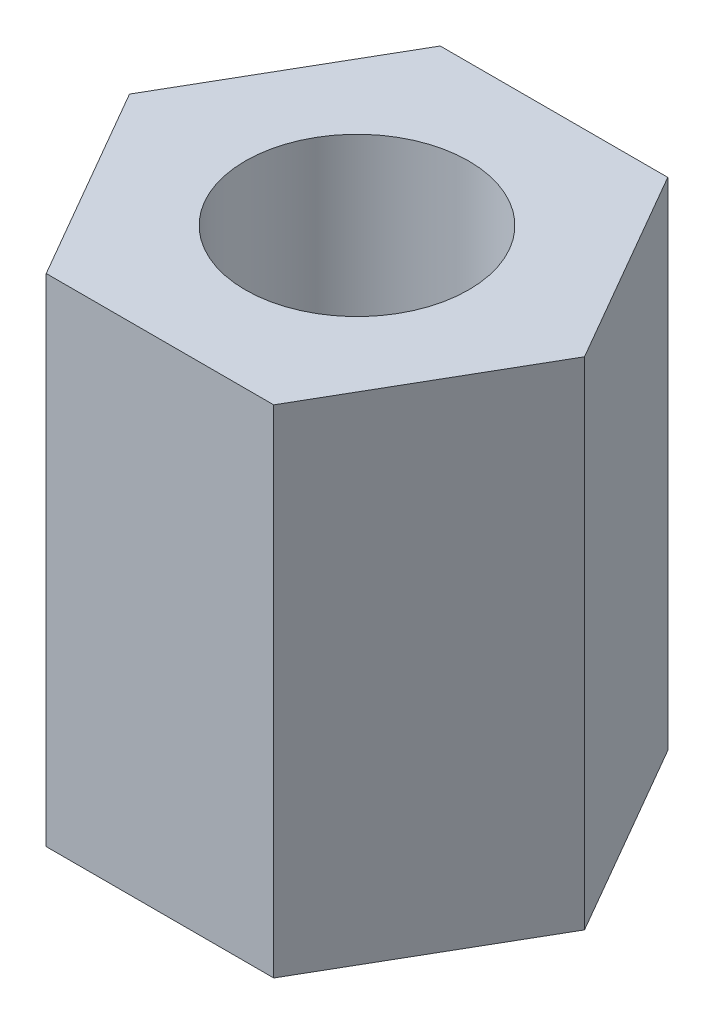
ISO-10303-21;
HEADER;
FILE_DESCRIPTION(('STEP AP214'),'2;1');
FILE_NAME('part.step','',(''),(''),'','','');
FILE_SCHEMA(('AUTOMOTIVE_DESIGN { 1 0 10303 214 1 1 1 1 }'));
ENDSEC;
DATA;
#1=APPLICATION_CONTEXT('core data for automotive mechanical design processes');
#2=APPLICATION_PROTOCOL_DEFINITION('international standard','automotive_design',2000,#1);
#3=PRODUCT_CONTEXT('',#1,'mechanical');
#4=PRODUCT('Part','Part','',(#3));
#5=PRODUCT_RELATED_PRODUCT_CATEGORY('part','',(#4));
#6=PRODUCT_DEFINITION_FORMATION('','',#4);
#7=PRODUCT_DEFINITION_CONTEXT('part definition',#1,'design');
#8=PRODUCT_DEFINITION('design','',#6,#7);
#9=PRODUCT_DEFINITION_SHAPE('','',#8);
#10=(LENGTH_UNIT() NAMED_UNIT(*) SI_UNIT(.MILLI.,.METRE.));
#11=(NAMED_UNIT(*) PLANE_ANGLE_UNIT() SI_UNIT($,.RADIAN.));
#12=(NAMED_UNIT(*) SI_UNIT($,.STERADIAN.) SOLID_ANGLE_UNIT());
#13=UNCERTAINTY_MEASURE_WITH_UNIT(LENGTH_MEASURE(1.E-05),#10,'distance_accuracy_value','');
#14=(GEOMETRIC_REPRESENTATION_CONTEXT(3) GLOBAL_UNCERTAINTY_ASSIGNED_CONTEXT((#13)) GLOBAL_UNIT_ASSIGNED_CONTEXT((#10,
#11,#12)) REPRESENTATION_CONTEXT('',''));
#15=CARTESIAN_POINT('',(0.,0.,0.));
#16=DIRECTION('',(0.,0.,1.));
#17=DIRECTION('',(1.,0.,0.));
#18=AXIS2_PLACEMENT_3D('',#15,#16,#17);
#19=CARTESIAN_POINT('',(0.,6.,0.));
#20=DIRECTION('',(0.,1.,0.));
#21=DIRECTION('',(0.,0.,1.));
#22=AXIS2_PLACEMENT_3D('',#19,#20,#21);
#23=PLANE('',#22);
#24=DIRECTION('',(0.499999999999995,0.,-0.866025403784441));
#25=VECTOR('',#24,1.);
#26=CARTESIAN_POINT('',(1.37500000000003,6.,2.38156986040719));
#27=LINE('',#26,#25);
#28=CARTESIAN_POINT('',(1.37500000000003,6.,2.38156986040719));
#29=VERTEX_POINT('',#28);
#30=CARTESIAN_POINT('',(2.75,6.,0.));
#31=VERTEX_POINT('',#30);
#32=EDGE_CURVE('E128',#29,#31,#27,.T.);
#33=ORIENTED_EDGE('',*,*,#32,.T.);
#34=DIRECTION('',(-0.500000000000001,0.,-0.866025403784438));
#35=VECTOR('',#34,1.);
#36=CARTESIAN_POINT('',(2.75,6.,0.));
#37=LINE('',#36,#35);
#38=CARTESIAN_POINT('',(1.37499999999999,6.,-2.38156986040721));
#39=VERTEX_POINT('',#38);
#40=EDGE_CURVE('E86',#31,#39,#37,.T.);
#41=ORIENTED_EDGE('',*,*,#40,.T.);
#42=DIRECTION('',(-1.,0.,0.));
#43=VECTOR('',#42,1.);
#44=CARTESIAN_POINT('',(1.37499999999999,6.,-2.38156986040721));
#45=LINE('',#44,#43);
#46=CARTESIAN_POINT('',(-1.37500000000001,6.,-2.3815698604072));
#47=VERTEX_POINT('',#46);
#48=EDGE_CURVE('E99',#39,#47,#45,.T.);
#49=ORIENTED_EDGE('',*,*,#48,.T.);
#50=DIRECTION('',(-0.499999999999995,0.,0.866025403784441));
#51=VECTOR('',#50,1.);
#52=CARTESIAN_POINT('',(-1.37500000000001,6.,-2.3815698604072));
#53=LINE('',#52,#51);
#54=CARTESIAN_POINT('',(-2.75,6.,0.));
#55=VERTEX_POINT('',#54);
#56=EDGE_CURVE('E93',#47,#55,#53,.T.);
#57=ORIENTED_EDGE('',*,*,#56,.T.);
#58=DIRECTION('',(0.500000000000007,0.,0.866025403784434));
#59=VECTOR('',#58,1.);
#60=CARTESIAN_POINT('',(-2.75,6.,0.));
#61=LINE('',#60,#59);
#62=CARTESIAN_POINT('',(-1.37499999999998,6.,2.38156986040722));
#63=VERTEX_POINT('',#62);
#64=EDGE_CURVE('E97',#55,#63,#61,.T.);
#65=ORIENTED_EDGE('',*,*,#64,.T.);
#66=DIRECTION('',(1.,0.,0.));
#67=VECTOR('',#66,1.);
#68=CARTESIAN_POINT('',(-1.37499999999998,6.,2.38156986040722));
#69=LINE('',#68,#67);
#70=EDGE_CURVE('E49',#63,#29,#69,.T.);
#71=ORIENTED_EDGE('',*,*,#70,.T.);
#72=EDGE_LOOP('',(#33,#41,#49,#57,#65,#71));
#73=FACE_BOUND('',#72,.T.);
#74=CARTESIAN_POINT('',(0.,6.,0.));
#75=DIRECTION('',(0.,1.,0.));
#76=DIRECTION('',(0.,0.,1.));
#77=AXIS2_PLACEMENT_3D('',#74,#75,#76);
#78=CIRCLE('',#77,1.35);
#79=CARTESIAN_POINT('',(0.,6.,1.35));
#80=VERTEX_POINT('',#79);
#81=EDGE_CURVE('E121',#80,#80,#78,.T.);
#82=ORIENTED_EDGE('',*,*,#81,.F.);
#83=EDGE_LOOP('',(#82));
#84=FACE_BOUND('',#83,.T.);
#85=ADVANCED_FACE('F32',(#73,#84),#23,.T.);
#86=CARTESIAN_POINT('',(0.,0.,0.));
#87=DIRECTION('',(0.,1.,0.));
#88=DIRECTION('',(0.,0.,1.));
#89=AXIS2_PLACEMENT_3D('',#86,#87,#88);
#90=PLANE('',#89);
#91=DIRECTION('',(0.499999999999995,0.,-0.866025403784441));
#92=VECTOR('',#91,1.);
#93=CARTESIAN_POINT('',(1.37500000000003,0.,2.38156986040719));
#94=LINE('',#93,#92);
#95=CARTESIAN_POINT('',(1.37500000000003,0.,2.38156986040719));
#96=VERTEX_POINT('',#95);
#97=CARTESIAN_POINT('',(2.75,0.,0.));
#98=VERTEX_POINT('',#97);
#99=EDGE_CURVE('E117',#96,#98,#94,.T.);
#100=ORIENTED_EDGE('',*,*,#99,.F.);
#101=DIRECTION('',(1.,0.,0.));
#102=VECTOR('',#101,1.);
#103=CARTESIAN_POINT('',(-1.37499999999998,0.,2.38156986040722));
#104=LINE('',#103,#102);
#105=CARTESIAN_POINT('',(-1.37499999999998,0.,2.38156986040722));
#106=VERTEX_POINT('',#105);
#107=EDGE_CURVE('E78',#106,#96,#104,.T.);
#108=ORIENTED_EDGE('',*,*,#107,.F.);
#109=DIRECTION('',(0.500000000000007,0.,0.866025403784434));
#110=VECTOR('',#109,1.);
#111=CARTESIAN_POINT('',(-2.75,0.,0.));
#112=LINE('',#111,#110);
#113=CARTESIAN_POINT('',(-2.75,0.,0.));
#114=VERTEX_POINT('',#113);
#115=EDGE_CURVE('E72',#114,#106,#112,.T.);
#116=ORIENTED_EDGE('',*,*,#115,.F.);
#117=DIRECTION('',(-0.499999999999995,0.,0.866025403784441));
#118=VECTOR('',#117,1.);
#119=CARTESIAN_POINT('',(-1.37500000000001,0.,-2.3815698604072));
#120=LINE('',#119,#118);
#121=CARTESIAN_POINT('',(-1.37500000000001,0.,-2.3815698604072));
#122=VERTEX_POINT('',#121);
#123=EDGE_CURVE('E107',#122,#114,#120,.T.);
#124=ORIENTED_EDGE('',*,*,#123,.F.);
#125=DIRECTION('',(-1.,0.,0.));
#126=VECTOR('',#125,1.);
#127=CARTESIAN_POINT('',(1.37499999999999,0.,-2.38156986040721));
#128=LINE('',#127,#126);
#129=CARTESIAN_POINT('',(1.37499999999999,0.,-2.38156986040721));
#130=VERTEX_POINT('',#129);
#131=EDGE_CURVE('E123',#130,#122,#128,.T.);
#132=ORIENTED_EDGE('',*,*,#131,.F.);
#133=DIRECTION('',(-0.500000000000001,0.,-0.866025403784438));
#134=VECTOR('',#133,1.);
#135=CARTESIAN_POINT('',(2.75,0.,0.));
#136=LINE('',#135,#134);
#137=EDGE_CURVE('E120',#98,#130,#136,.T.);
#138=ORIENTED_EDGE('',*,*,#137,.F.);
#139=EDGE_LOOP('',(#100,#108,#116,#124,#132,#138));
#140=FACE_BOUND('',#139,.T.);
#141=CARTESIAN_POINT('',(0.,0.,0.));
#142=DIRECTION('',(0.,1.,0.));
#143=DIRECTION('',(0.,0.,1.));
#144=AXIS2_PLACEMENT_3D('',#141,#142,#143);
#145=CIRCLE('',#144,1.35);
#146=CARTESIAN_POINT('',(0.,0.,1.35));
#147=VERTEX_POINT('',#146);
#148=EDGE_CURVE('E221',#147,#147,#145,.T.);
#149=ORIENTED_EDGE('',*,*,#148,.T.);
#150=EDGE_LOOP('',(#149));
#151=FACE_BOUND('',#150,.T.);
#152=ADVANCED_FACE('F137',(#140,#151),#90,.F.);
#153=CARTESIAN_POINT('',(1.37500000000003,6.,2.38156986040719));
#154=DIRECTION('',(-0.866025403784442,0.,-0.499999999999995));
#155=DIRECTION('',(-0.499999999999995,0.,0.866025403784442));
#156=AXIS2_PLACEMENT_3D('',#153,#154,#155);
#157=PLANE('',#156);
#158=ORIENTED_EDGE('',*,*,#99,.T.);
#159=DIRECTION('',(0.,-1.,0.));
#160=VECTOR('',#159,1.);
#161=CARTESIAN_POINT('',(2.75,6.,0.));
#162=LINE('',#161,#160);
#163=EDGE_CURVE('E11',#31,#98,#162,.T.);
#164=ORIENTED_EDGE('',*,*,#163,.F.);
#165=ORIENTED_EDGE('',*,*,#32,.F.);
#166=DIRECTION('',(0.,-1.,0.));
#167=VECTOR('',#166,1.);
#168=CARTESIAN_POINT('',(1.37500000000003,6.,2.38156986040719));
#169=LINE('',#168,#167);
#170=EDGE_CURVE('E113',#29,#96,#169,.T.);
#171=ORIENTED_EDGE('',*,*,#170,.T.);
#172=EDGE_LOOP('',(#158,#164,#165,#171));
#173=FACE_BOUND('',#172,.T.);
#174=ADVANCED_FACE('F34',(#173),#157,.F.);
#175=CARTESIAN_POINT('',(2.75,6.,0.));
#176=DIRECTION('',(-0.866025403784438,0.,0.500000000000001));
#177=DIRECTION('',(0.500000000000001,0.,0.866025403784438));
#178=AXIS2_PLACEMENT_3D('',#175,#176,#177);
#179=PLANE('',#178);
#180=ORIENTED_EDGE('',*,*,#137,.T.);
#181=DIRECTION('',(0.,-1.,0.));
#182=VECTOR('',#181,1.);
#183=CARTESIAN_POINT('',(1.37499999999999,6.,-2.38156986040721));
#184=LINE('',#183,#182);
#185=EDGE_CURVE('E41',#39,#130,#184,.T.);
#186=ORIENTED_EDGE('',*,*,#185,.F.);
#187=ORIENTED_EDGE('',*,*,#40,.F.);
#188=ORIENTED_EDGE('',*,*,#163,.T.);
#189=EDGE_LOOP('',(#180,#186,#187,#188));
#190=FACE_BOUND('',#189,.T.);
#191=ADVANCED_FACE('F162',(#190),#179,.F.);
#192=CARTESIAN_POINT('',(1.37499999999999,6.,-2.38156986040721));
#193=DIRECTION('',(0.,0.,1.));
#194=DIRECTION('',(1.,0.,0.));
#195=AXIS2_PLACEMENT_3D('',#192,#193,#194);
#196=PLANE('',#195);
#197=ORIENTED_EDGE('',*,*,#131,.T.);
#198=DIRECTION('',(0.,-1.,0.));
#199=VECTOR('',#198,1.);
#200=CARTESIAN_POINT('',(-1.37500000000001,6.,-2.3815698604072));
#201=LINE('',#200,#199);
#202=EDGE_CURVE('E108',#47,#122,#201,.T.);
#203=ORIENTED_EDGE('',*,*,#202,.F.);
#204=ORIENTED_EDGE('',*,*,#48,.F.);
#205=ORIENTED_EDGE('',*,*,#185,.T.);
#206=EDGE_LOOP('',(#197,#203,#204,#205));
#207=FACE_BOUND('',#206,.T.);
#208=ADVANCED_FACE('F134',(#207),#196,.F.);
#209=CARTESIAN_POINT('',(-1.37500000000001,6.,-2.3815698604072));
#210=DIRECTION('',(0.866025403784441,0.,0.499999999999995));
#211=DIRECTION('',(0.499999999999995,0.,-0.866025403784442));
#212=AXIS2_PLACEMENT_3D('',#209,#210,#211);
#213=PLANE('',#212);
#214=ORIENTED_EDGE('',*,*,#123,.T.);
#215=DIRECTION('',(0.,-1.,0.));
#216=VECTOR('',#215,1.);
#217=CARTESIAN_POINT('',(-2.75,6.,0.));
#218=LINE('',#217,#216);
#219=EDGE_CURVE('E104',#55,#114,#218,.T.);
#220=ORIENTED_EDGE('',*,*,#219,.F.);
#221=ORIENTED_EDGE('',*,*,#56,.F.);
#222=ORIENTED_EDGE('',*,*,#202,.T.);
#223=EDGE_LOOP('',(#214,#220,#221,#222));
#224=FACE_BOUND('',#223,.T.);
#225=ADVANCED_FACE('F105',(#224),#213,.F.);
#226=CARTESIAN_POINT('',(-2.75,6.,0.));
#227=DIRECTION('',(0.866025403784434,0.,-0.500000000000007));
#228=DIRECTION('',(-0.500000000000007,0.,-0.866025403784435));
#229=AXIS2_PLACEMENT_3D('',#226,#227,#228);
#230=PLANE('',#229);
#231=ORIENTED_EDGE('',*,*,#115,.T.);
#232=DIRECTION('',(0.,-1.,0.));
#233=VECTOR('',#232,1.);
#234=CARTESIAN_POINT('',(-1.37499999999998,6.,2.38156986040722));
#235=LINE('',#234,#233);
#236=EDGE_CURVE('E109',#63,#106,#235,.T.);
#237=ORIENTED_EDGE('',*,*,#236,.F.);
#238=ORIENTED_EDGE('',*,*,#64,.F.);
#239=ORIENTED_EDGE('',*,*,#219,.T.);
#240=EDGE_LOOP('',(#231,#237,#238,#239));
#241=FACE_BOUND('',#240,.T.);
#242=ADVANCED_FACE('F111',(#241),#230,.F.);
#243=CARTESIAN_POINT('',(-1.37499999999998,6.,2.38156986040722));
#244=DIRECTION('',(0.,0.,-1.));
#245=DIRECTION('',(-1.,0.,0.));
#246=AXIS2_PLACEMENT_3D('',#243,#244,#245);
#247=PLANE('',#246);
#248=ORIENTED_EDGE('',*,*,#107,.T.);
#249=ORIENTED_EDGE('',*,*,#170,.F.);
#250=ORIENTED_EDGE('',*,*,#70,.F.);
#251=ORIENTED_EDGE('',*,*,#236,.T.);
#252=EDGE_LOOP('',(#248,#249,#250,#251));
#253=FACE_BOUND('',#252,.T.);
#254=ADVANCED_FACE('F142',(#253),#247,.F.);
#255=CARTESIAN_POINT('',(0.,6.,0.));
#256=DIRECTION('',(0.,-1.,0.));
#257=DIRECTION('',(0.,0.,-1.));
#258=AXIS2_PLACEMENT_3D('',#255,#256,#257);
#259=CYLINDRICAL_SURFACE('',#258,1.35);
#260=ORIENTED_EDGE('',*,*,#81,.T.);
#261=EDGE_LOOP('',(#260));
#262=FACE_BOUND('',#261,.T.);
#263=ORIENTED_EDGE('',*,*,#148,.F.);
#264=EDGE_LOOP('',(#263));
#265=FACE_BOUND('',#264,.T.);
#266=ADVANCED_FACE('F144',(#262,#265),#259,.F.);
#267=CLOSED_SHELL('',(#85,#152,#174,#191,#208,#225,#242,#254,#266));
#268=MANIFOLD_SOLID_BREP('B2',#267);
#269=ADVANCED_BREP_SHAPE_REPRESENTATION('',(#18,#268),#14);
#270=SHAPE_DEFINITION_REPRESENTATION(#9,#269);
ENDSEC;
END-ISO-10303-21;
